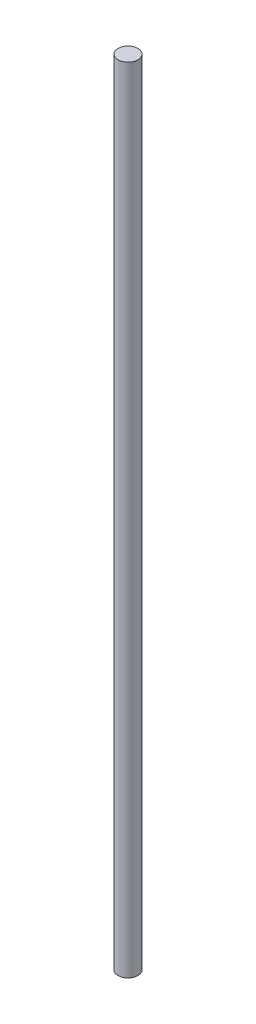
ISO-10303-21;
HEADER;
FILE_DESCRIPTION(('STEP AP214'),'2;1');
FILE_NAME('part.step','',(''),(''),'','','');
FILE_SCHEMA(('AUTOMOTIVE_DESIGN { 1 0 10303 214 1 1 1 1 }'));
ENDSEC;
DATA;
#1=APPLICATION_CONTEXT('core data for automotive mechanical design processes');
#2=APPLICATION_PROTOCOL_DEFINITION('international standard','automotive_design',2000,#1);
#3=PRODUCT_CONTEXT('',#1,'mechanical');
#4=PRODUCT('Part','Part','',(#3));
#5=PRODUCT_RELATED_PRODUCT_CATEGORY('part','',(#4));
#6=PRODUCT_DEFINITION_FORMATION('','',#4);
#7=PRODUCT_DEFINITION_CONTEXT('part definition',#1,'design');
#8=PRODUCT_DEFINITION('design','',#6,#7);
#9=PRODUCT_DEFINITION_SHAPE('','',#8);
#10=(LENGTH_UNIT() NAMED_UNIT(*) SI_UNIT(.MILLI.,.METRE.));
#11=(NAMED_UNIT(*) PLANE_ANGLE_UNIT() SI_UNIT($,.RADIAN.));
#12=(NAMED_UNIT(*) SI_UNIT($,.STERADIAN.) SOLID_ANGLE_UNIT());
#13=UNCERTAINTY_MEASURE_WITH_UNIT(LENGTH_MEASURE(1.E-05),#10,'distance_accuracy_value','');
#14=(GEOMETRIC_REPRESENTATION_CONTEXT(3) GLOBAL_UNCERTAINTY_ASSIGNED_CONTEXT((#13)) GLOBAL_UNIT_ASSIGNED_CONTEXT((#10,
#11,#12)) REPRESENTATION_CONTEXT('',''));
#15=CARTESIAN_POINT('',(0.,0.,0.));
#16=DIRECTION('',(0.,0.,1.));
#17=DIRECTION('',(1.,0.,0.));
#18=AXIS2_PLACEMENT_3D('',#15,#16,#17);
#19=CARTESIAN_POINT('',(0.,400.,0.));
#20=DIRECTION('',(0.,-1.,0.));
#21=DIRECTION('',(0.,0.,-1.));
#22=AXIS2_PLACEMENT_3D('',#19,#20,#21);
#23=CYLINDRICAL_SURFACE('',#22,5.);
#24=CARTESIAN_POINT('',(0.,400.,0.));
#25=DIRECTION('',(0.,1.,0.));
#26=DIRECTION('',(0.,0.,1.));
#27=AXIS2_PLACEMENT_3D('',#24,#25,#26);
#28=CIRCLE('',#27,5.);
#29=CARTESIAN_POINT('',(0.,400.,5.));
#30=VERTEX_POINT('',#29);
#31=EDGE_CURVE('E10',#30,#30,#28,.T.);
#32=ORIENTED_EDGE('',*,*,#31,.F.);
#33=EDGE_LOOP('',(#32));
#34=FACE_BOUND('',#33,.T.);
#35=CARTESIAN_POINT('',(0.,0.,0.));
#36=DIRECTION('',(0.,1.,0.));
#37=DIRECTION('',(0.,0.,1.));
#38=AXIS2_PLACEMENT_3D('',#35,#36,#37);
#39=CIRCLE('',#38,5.);
#40=CARTESIAN_POINT('',(0.,0.,5.));
#41=VERTEX_POINT('',#40);
#42=EDGE_CURVE('E33',#41,#41,#39,.T.);
#43=ORIENTED_EDGE('',*,*,#42,.T.);
#44=EDGE_LOOP('',(#43));
#45=FACE_BOUND('',#44,.T.);
#46=ADVANCED_FACE('F30',(#34,#45),#23,.T.);
#47=CARTESIAN_POINT('',(0.,400.,0.));
#48=DIRECTION('',(0.,1.,0.));
#49=DIRECTION('',(0.,0.,1.));
#50=AXIS2_PLACEMENT_3D('',#47,#48,#49);
#51=PLANE('',#50);
#52=ORIENTED_EDGE('',*,*,#31,.T.);
#53=EDGE_LOOP('',(#52));
#54=FACE_BOUND('',#53,.T.);
#55=ADVANCED_FACE('F45',(#54),#51,.T.);
#56=CARTESIAN_POINT('',(0.,0.,0.));
#57=DIRECTION('',(0.,1.,0.));
#58=DIRECTION('',(0.,0.,1.));
#59=AXIS2_PLACEMENT_3D('',#56,#57,#58);
#60=PLANE('',#59);
#61=ORIENTED_EDGE('',*,*,#42,.F.);
#62=EDGE_LOOP('',(#61));
#63=FACE_BOUND('',#62,.T.);
#64=ADVANCED_FACE('F43',(#63),#60,.F.);
#65=CLOSED_SHELL('',(#46,#55,#64));
#66=MANIFOLD_SOLID_BREP('B2',#65);
#67=ADVANCED_BREP_SHAPE_REPRESENTATION('',(#18,#66),#14);
#68=SHAPE_DEFINITION_REPRESENTATION(#9,#67);
ENDSEC;
END-ISO-10303-21;
